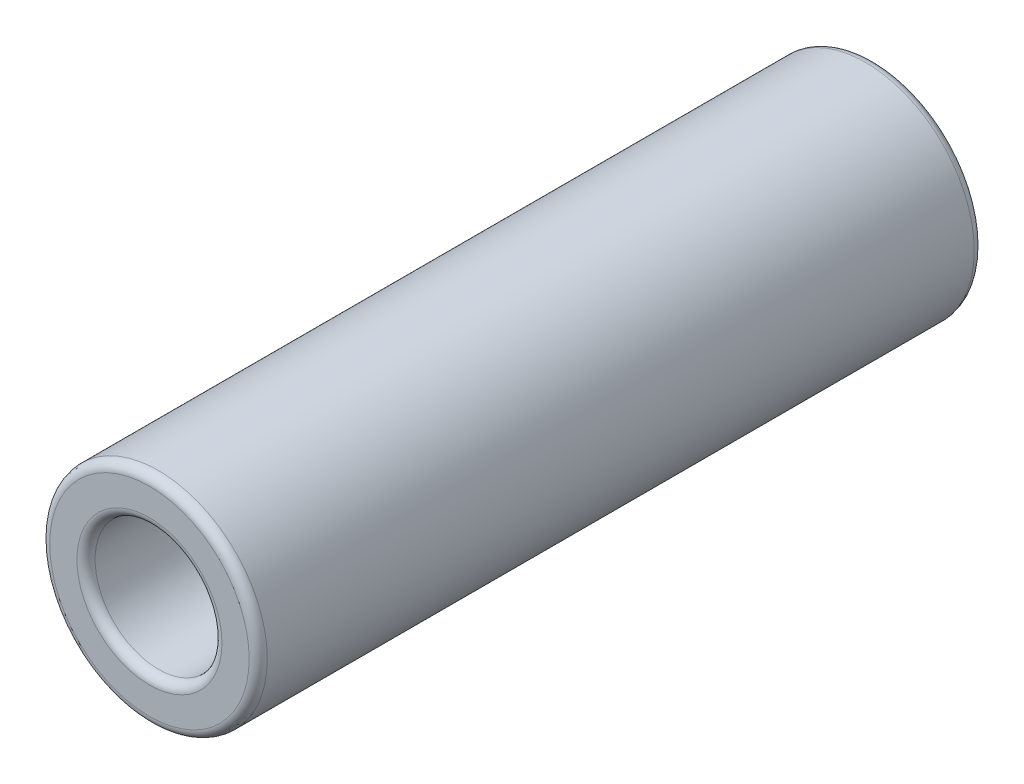
ISO-10303-21;
HEADER;
FILE_DESCRIPTION(('STEP AP214'),'2;1');
FILE_NAME('part.step','',(''),(''),'','','');
FILE_SCHEMA(('AUTOMOTIVE_DESIGN { 1 0 10303 214 1 1 1 1 }'));
ENDSEC;
DATA;
#1=APPLICATION_CONTEXT('core data for automotive mechanical design processes');
#2=APPLICATION_PROTOCOL_DEFINITION('international standard','automotive_design',2000,#1);
#3=PRODUCT_CONTEXT('',#1,'mechanical');
#4=PRODUCT('Part','Part','',(#3));
#5=PRODUCT_RELATED_PRODUCT_CATEGORY('part','',(#4));
#6=PRODUCT_DEFINITION_FORMATION('','',#4);
#7=PRODUCT_DEFINITION_CONTEXT('part definition',#1,'design');
#8=PRODUCT_DEFINITION('design','',#6,#7);
#9=PRODUCT_DEFINITION_SHAPE('','',#8);
#10=(LENGTH_UNIT() NAMED_UNIT(*) SI_UNIT(.MILLI.,.METRE.));
#11=(NAMED_UNIT(*) PLANE_ANGLE_UNIT() SI_UNIT($,.RADIAN.));
#12=(NAMED_UNIT(*) SI_UNIT($,.STERADIAN.) SOLID_ANGLE_UNIT());
#13=UNCERTAINTY_MEASURE_WITH_UNIT(LENGTH_MEASURE(1.E-05),#10,'distance_accuracy_value','');
#14=(GEOMETRIC_REPRESENTATION_CONTEXT(3) GLOBAL_UNCERTAINTY_ASSIGNED_CONTEXT((#13)) GLOBAL_UNIT_ASSIGNED_CONTEXT((#10,
#11,#12)) REPRESENTATION_CONTEXT('',''));
#15=CARTESIAN_POINT('',(0.,0.,0.));
#16=DIRECTION('',(0.,0.,1.));
#17=DIRECTION('',(1.,0.,0.));
#18=AXIS2_PLACEMENT_3D('',#15,#16,#17);
#19=CARTESIAN_POINT('',(0.,0.,-40.));
#20=DIRECTION('',(0.,0.,1.));
#21=DIRECTION('',(1.,0.,0.));
#22=AXIS2_PLACEMENT_3D('',#19,#20,#21);
#23=CYLINDRICAL_SURFACE('',#22,6.);
#24=CARTESIAN_POINT('',(0.,0.,-39.5));
#25=DIRECTION('',(0.,0.,1.));
#26=DIRECTION('',(1.,0.,0.));
#27=AXIS2_PLACEMENT_3D('',#24,#25,#26);
#28=CIRCLE('',#27,6.);
#29=CARTESIAN_POINT('',(6.,0.,-39.5));
#30=VERTEX_POINT('',#29);
#31=EDGE_CURVE('E68',#30,#30,#28,.T.);
#32=ORIENTED_EDGE('',*,*,#31,.T.);
#33=EDGE_LOOP('',(#32));
#34=FACE_BOUND('',#33,.T.);
#35=CARTESIAN_POINT('',(0.,0.,-0.5));
#36=DIRECTION('',(0.,0.,1.));
#37=DIRECTION('',(1.,0.,0.));
#38=AXIS2_PLACEMENT_3D('',#35,#36,#37);
#39=CIRCLE('',#38,6.);
#40=CARTESIAN_POINT('',(6.,0.,-0.5));
#41=VERTEX_POINT('',#40);
#42=EDGE_CURVE('E72',#41,#41,#39,.F.);
#43=ORIENTED_EDGE('',*,*,#42,.T.);
#44=EDGE_LOOP('',(#43));
#45=FACE_BOUND('',#44,.T.);
#46=ADVANCED_FACE('F36',(#34,#45),#23,.T.);
#47=CARTESIAN_POINT('',(0.,0.,-40.));
#48=DIRECTION('',(0.,0.,1.));
#49=DIRECTION('',(1.,0.,0.));
#50=AXIS2_PLACEMENT_3D('',#47,#48,#49);
#51=PLANE('',#50);
#52=CARTESIAN_POINT('',(0.,0.,-40.));
#53=DIRECTION('',(0.,0.,1.));
#54=DIRECTION('',(1.,0.,0.));
#55=AXIS2_PLACEMENT_3D('',#52,#53,#54);
#56=CIRCLE('',#55,4.);
#57=CARTESIAN_POINT('',(4.,0.,-40.));
#58=VERTEX_POINT('',#57);
#59=EDGE_CURVE('E54',#58,#58,#56,.T.);
#60=ORIENTED_EDGE('',*,*,#59,.T.);
#61=EDGE_LOOP('',(#60));
#62=FACE_BOUND('',#61,.T.);
#63=CARTESIAN_POINT('',(0.,0.,-40.));
#64=DIRECTION('',(0.,0.,1.));
#65=DIRECTION('',(1.,0.,0.));
#66=AXIS2_PLACEMENT_3D('',#63,#64,#65);
#67=CIRCLE('',#66,5.5);
#68=CARTESIAN_POINT('',(5.5,0.,-40.));
#69=VERTEX_POINT('',#68);
#70=EDGE_CURVE('E64',#69,#69,#67,.F.);
#71=ORIENTED_EDGE('',*,*,#70,.T.);
#72=EDGE_LOOP('',(#71));
#73=FACE_BOUND('',#72,.T.);
#74=ADVANCED_FACE('F89',(#62,#73),#51,.F.);
#75=CARTESIAN_POINT('',(0.,0.,0.));
#76=DIRECTION('',(0.,0.,1.));
#77=DIRECTION('',(1.,0.,0.));
#78=AXIS2_PLACEMENT_3D('',#75,#76,#77);
#79=PLANE('',#78);
#80=CARTESIAN_POINT('',(0.,0.,0.));
#81=DIRECTION('',(0.,0.,1.));
#82=DIRECTION('',(1.,0.,0.));
#83=AXIS2_PLACEMENT_3D('',#80,#81,#82);
#84=CIRCLE('',#83,4.);
#85=CARTESIAN_POINT('',(4.,0.,0.));
#86=VERTEX_POINT('',#85);
#87=EDGE_CURVE('E10',#86,#86,#84,.F.);
#88=ORIENTED_EDGE('',*,*,#87,.T.);
#89=EDGE_LOOP('',(#88));
#90=FACE_BOUND('',#89,.T.);
#91=CARTESIAN_POINT('',(0.,0.,0.));
#92=DIRECTION('',(0.,0.,1.));
#93=DIRECTION('',(1.,0.,0.));
#94=AXIS2_PLACEMENT_3D('',#91,#92,#93);
#95=CIRCLE('',#94,5.5);
#96=CARTESIAN_POINT('',(5.5,0.,0.));
#97=VERTEX_POINT('',#96);
#98=EDGE_CURVE('E60',#97,#97,#95,.T.);
#99=ORIENTED_EDGE('',*,*,#98,.T.);
#100=EDGE_LOOP('',(#99));
#101=FACE_BOUND('',#100,.T.);
#102=ADVANCED_FACE('F86',(#90,#101),#79,.T.);
#103=CARTESIAN_POINT('',(0.,0.,-40.));
#104=DIRECTION('',(0.,0.,1.));
#105=DIRECTION('',(1.,0.,0.));
#106=AXIS2_PLACEMENT_3D('',#103,#104,#105);
#107=CYLINDRICAL_SURFACE('',#106,3.5);
#108=CARTESIAN_POINT('',(0.,0.,-39.5));
#109=DIRECTION('',(0.,0.,1.));
#110=DIRECTION('',(1.,0.,0.));
#111=AXIS2_PLACEMENT_3D('',#108,#109,#110);
#112=CIRCLE('',#111,3.5);
#113=CARTESIAN_POINT('',(3.5,0.,-39.5));
#114=VERTEX_POINT('',#113);
#115=EDGE_CURVE('E44',#114,#114,#112,.F.);
#116=ORIENTED_EDGE('',*,*,#115,.T.);
#117=EDGE_LOOP('',(#116));
#118=FACE_BOUND('',#117,.T.);
#119=CARTESIAN_POINT('',(0.,0.,-0.5));
#120=DIRECTION('',(0.,0.,1.));
#121=DIRECTION('',(1.,0.,0.));
#122=AXIS2_PLACEMENT_3D('',#119,#120,#121);
#123=CIRCLE('',#122,3.5);
#124=CARTESIAN_POINT('',(3.5,0.,-0.5));
#125=VERTEX_POINT('',#124);
#126=EDGE_CURVE('E49',#125,#125,#123,.T.);
#127=ORIENTED_EDGE('',*,*,#126,.T.);
#128=EDGE_LOOP('',(#127));
#129=FACE_BOUND('',#128,.T.);
#130=ADVANCED_FACE('F88',(#118,#129),#107,.F.);
#131=CARTESIAN_POINT('',(0.,0.,-39.5));
#132=DIRECTION('',(0.,0.,1.));
#133=DIRECTION('',(1.,0.,0.));
#134=AXIS2_PLACEMENT_3D('',#131,#132,#133);
#135=TOROIDAL_SURFACE('',#134,5.5,0.5);
#136=ORIENTED_EDGE('',*,*,#70,.F.);
#137=EDGE_LOOP('',(#136));
#138=FACE_BOUND('',#137,.T.);
#139=ORIENTED_EDGE('',*,*,#31,.F.);
#140=EDGE_LOOP('',(#139));
#141=FACE_BOUND('',#140,.T.);
#142=ADVANCED_FACE('F82',(#138,#141),#135,.T.);
#143=CARTESIAN_POINT('',(0.,0.,-0.5));
#144=DIRECTION('',(0.,0.,1.));
#145=DIRECTION('',(1.,0.,0.));
#146=AXIS2_PLACEMENT_3D('',#143,#144,#145);
#147=TOROIDAL_SURFACE('',#146,5.5,0.5);
#148=ORIENTED_EDGE('',*,*,#42,.F.);
#149=EDGE_LOOP('',(#148));
#150=FACE_BOUND('',#149,.T.);
#151=ORIENTED_EDGE('',*,*,#98,.F.);
#152=EDGE_LOOP('',(#151));
#153=FACE_BOUND('',#152,.T.);
#154=ADVANCED_FACE('F78',(#150,#153),#147,.T.);
#155=CARTESIAN_POINT('',(0.,0.,-39.5));
#156=DIRECTION('',(0.,0.,1.));
#157=DIRECTION('',(1.,0.,0.));
#158=AXIS2_PLACEMENT_3D('',#155,#156,#157);
#159=TOROIDAL_SURFACE('',#158,4.,0.5);
#160=ORIENTED_EDGE('',*,*,#115,.F.);
#161=EDGE_LOOP('',(#160));
#162=FACE_BOUND('',#161,.T.);
#163=ORIENTED_EDGE('',*,*,#59,.F.);
#164=EDGE_LOOP('',(#163));
#165=FACE_BOUND('',#164,.T.);
#166=ADVANCED_FACE('F81',(#162,#165),#159,.T.);
#167=CARTESIAN_POINT('',(0.,0.,-0.5));
#168=DIRECTION('',(0.,0.,1.));
#169=DIRECTION('',(1.,0.,0.));
#170=AXIS2_PLACEMENT_3D('',#167,#168,#169);
#171=TOROIDAL_SURFACE('',#170,4.,0.5);
#172=ORIENTED_EDGE('',*,*,#87,.F.);
#173=EDGE_LOOP('',(#172));
#174=FACE_BOUND('',#173,.T.);
#175=ORIENTED_EDGE('',*,*,#126,.F.);
#176=EDGE_LOOP('',(#175));
#177=FACE_BOUND('',#176,.T.);
#178=ADVANCED_FACE('F38',(#174,#177),#171,.T.);
#179=CLOSED_SHELL('',(#46,#74,#102,#130,#142,#154,#166,#178));
#180=MANIFOLD_SOLID_BREP('B2',#179);
#181=ADVANCED_BREP_SHAPE_REPRESENTATION('',(#18,#180),#14);
#182=SHAPE_DEFINITION_REPRESENTATION(#9,#181);
ENDSEC;
END-ISO-10303-21;
